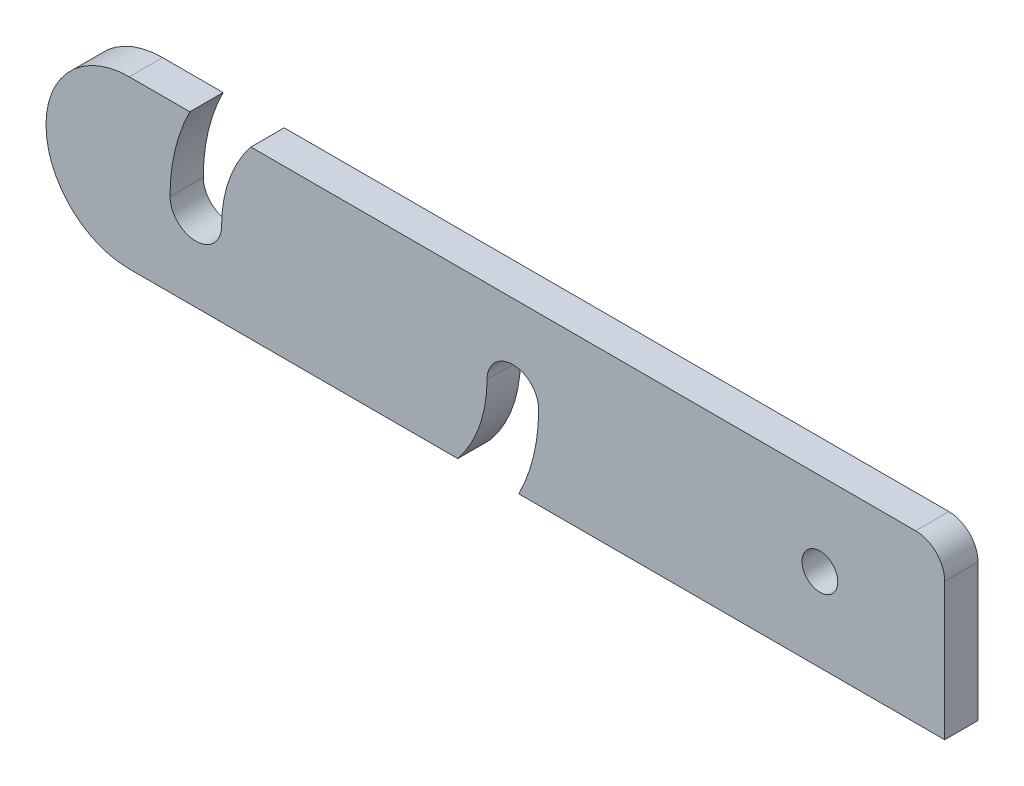
ISO-10303-21;
HEADER;
FILE_DESCRIPTION(('STEP AP214'),'2;1');
FILE_NAME('part.step','',(''),(''),'','','');
FILE_SCHEMA(('AUTOMOTIVE_DESIGN { 1 0 10303 214 1 1 1 1 }'));
ENDSEC;
DATA;
#1=APPLICATION_CONTEXT('core data for automotive mechanical design processes');
#2=APPLICATION_PROTOCOL_DEFINITION('international standard','automotive_design',2000,#1);
#3=PRODUCT_CONTEXT('',#1,'mechanical');
#4=PRODUCT('Part','Part','',(#3));
#5=PRODUCT_RELATED_PRODUCT_CATEGORY('part','',(#4));
#6=PRODUCT_DEFINITION_FORMATION('','',#4);
#7=PRODUCT_DEFINITION_CONTEXT('part definition',#1,'design');
#8=PRODUCT_DEFINITION('design','',#6,#7);
#9=PRODUCT_DEFINITION_SHAPE('','',#8);
#10=(LENGTH_UNIT() NAMED_UNIT(*) SI_UNIT(.MILLI.,.METRE.));
#11=(NAMED_UNIT(*) PLANE_ANGLE_UNIT() SI_UNIT($,.RADIAN.));
#12=(NAMED_UNIT(*) SI_UNIT($,.STERADIAN.) SOLID_ANGLE_UNIT());
#13=UNCERTAINTY_MEASURE_WITH_UNIT(LENGTH_MEASURE(1.E-05),#10,'distance_accuracy_value','');
#14=(GEOMETRIC_REPRESENTATION_CONTEXT(3) GLOBAL_UNCERTAINTY_ASSIGNED_CONTEXT((#13)) GLOBAL_UNIT_ASSIGNED_CONTEXT((#10,
#11,#12)) REPRESENTATION_CONTEXT('',''));
#15=CARTESIAN_POINT('',(0.,0.,0.));
#16=DIRECTION('',(0.,0.,1.));
#17=DIRECTION('',(1.,0.,0.));
#18=AXIS2_PLACEMENT_3D('',#15,#16,#17);
#19=CARTESIAN_POINT('',(75.8050130843792,3.5,4.));
#20=DIRECTION('',(0.,0.,1.));
#21=DIRECTION('',(1.,0.,0.));
#22=AXIS2_PLACEMENT_3D('',#19,#20,#21);
#23=PLANE('',#22);
#24=CARTESIAN_POINT('',(75.8050130843792,3.5,4.));
#25=DIRECTION('',(0.,0.,1.));
#26=DIRECTION('',(1.,0.,0.));
#27=AXIS2_PLACEMENT_3D('',#24,#25,#26);
#28=CIRCLE('',#27,3.5);
#29=CARTESIAN_POINT('',(79.3050130843792,3.49999999999998,4.));
#30=VERTEX_POINT('',#29);
#31=CARTESIAN_POINT('',(75.8050130843792,7.00000000000001,4.));
#32=VERTEX_POINT('',#31);
#33=EDGE_CURVE('E183',#30,#32,#28,.T.);
#34=ORIENTED_EDGE('',*,*,#33,.T.);
#35=DIRECTION('',(-1.,0.,0.));
#36=VECTOR('',#35,1.);
#37=CARTESIAN_POINT('',(-4.07157603148119,7.00000000000001,4.));
#38=LINE('',#37,#36);
#39=CARTESIAN_POINT('',(-4.07157603148119,7.00000000000001,4.));
#40=VERTEX_POINT('',#39);
#41=EDGE_CURVE('E106',#32,#40,#38,.T.);
#42=ORIENTED_EDGE('',*,*,#41,.T.);
#43=CARTESIAN_POINT('',(8.35751308437922,-3.,4.));
#44=DIRECTION('',(0.,0.,1.));
#45=DIRECTION('',(1.,0.,0.));
#46=AXIS2_PLACEMENT_3D('',#43,#44,#45);
#47=CIRCLE('',#46,15.9525);
#48=CARTESIAN_POINT('',(-7.59498691562078,-3.,4.));
#49=VERTEX_POINT('',#48);
#50=EDGE_CURVE('E213',#40,#49,#47,.T.);
#51=ORIENTED_EDGE('',*,*,#50,.T.);
#52=CARTESIAN_POINT('',(-10.6949869156208,-3.,4.));
#53=DIRECTION('',(0.,0.,-1.));
#54=DIRECTION('',(1.,0.,0.));
#55=AXIS2_PLACEMENT_3D('',#52,#53,#54);
#56=CIRCLE('',#55,3.1);
#57=CARTESIAN_POINT('',(-13.7949869156208,-3.,4.));
#58=VERTEX_POINT('',#57);
#59=EDGE_CURVE('E232',#49,#58,#56,.T.);
#60=ORIENTED_EDGE('',*,*,#59,.T.);
#61=CARTESIAN_POINT('',(8.35751308437922,-3.,4.));
#62=DIRECTION('',(0.,0.,-1.));
#63=DIRECTION('',(1.,0.,0.));
#64=AXIS2_PLACEMENT_3D('',#61,#62,#63);
#65=CIRCLE('',#64,22.1525);
#66=CARTESIAN_POINT('',(-11.4094607925196,7.00000000000001,4.));
#67=VERTEX_POINT('',#66);
#68=EDGE_CURVE('E229',#58,#67,#65,.T.);
#69=ORIENTED_EDGE('',*,*,#68,.T.);
#70=DIRECTION('',(-1.,0.,0.));
#71=VECTOR('',#70,1.);
#72=CARTESIAN_POINT('',(-18.6949869156208,7.00000000000001,4.));
#73=LINE('',#72,#71);
#74=CARTESIAN_POINT('',(-18.6949869156208,7.00000000000001,4.));
#75=VERTEX_POINT('',#74);
#76=EDGE_CURVE('E231',#67,#75,#73,.T.);
#77=ORIENTED_EDGE('',*,*,#76,.T.);
#78=CARTESIAN_POINT('',(-18.6949869156208,-3.,4.));
#79=DIRECTION('',(0.,0.,1.));
#80=DIRECTION('',(-1.,0.,0.));
#81=AXIS2_PLACEMENT_3D('',#78,#79,#80);
#82=CIRCLE('',#81,10.);
#83=CARTESIAN_POINT('',(-18.6949869156208,-13.,4.));
#84=VERTEX_POINT('',#83);
#85=EDGE_CURVE('E234',#75,#84,#82,.T.);
#86=ORIENTED_EDGE('',*,*,#85,.T.);
#87=DIRECTION('',(1.,0.,0.));
#88=VECTOR('',#87,1.);
#89=CARTESIAN_POINT('',(20.7866022002396,-13.,4.));
#90=LINE('',#89,#88);
#91=CARTESIAN_POINT('',(20.7866022002396,-13.,4.));
#92=VERTEX_POINT('',#91);
#93=EDGE_CURVE('E240',#84,#92,#90,.T.);
#94=ORIENTED_EDGE('',*,*,#93,.T.);
#95=CARTESIAN_POINT('',(8.35751308437922,-3.,4.));
#96=DIRECTION('',(0.,0.,1.));
#97=DIRECTION('',(1.,0.,0.));
#98=AXIS2_PLACEMENT_3D('',#95,#96,#97);
#99=CIRCLE('',#98,15.9525);
#100=CARTESIAN_POINT('',(24.3100130843792,-3.,4.));
#101=VERTEX_POINT('',#100);
#102=EDGE_CURVE('E242',#92,#101,#99,.T.);
#103=ORIENTED_EDGE('',*,*,#102,.T.);
#104=CARTESIAN_POINT('',(27.4100130843792,-3.,4.));
#105=DIRECTION('',(0.,0.,-1.));
#106=DIRECTION('',(1.,0.,0.));
#107=AXIS2_PLACEMENT_3D('',#104,#105,#106);
#108=CIRCLE('',#107,3.1);
#109=CARTESIAN_POINT('',(30.5100130843792,-3.,4.));
#110=VERTEX_POINT('',#109);
#111=EDGE_CURVE('E140',#101,#110,#108,.T.);
#112=ORIENTED_EDGE('',*,*,#111,.T.);
#113=CARTESIAN_POINT('',(8.35751308437922,-3.,4.));
#114=DIRECTION('',(0.,0.,-1.));
#115=DIRECTION('',(1.,0.,0.));
#116=AXIS2_PLACEMENT_3D('',#113,#114,#115);
#117=CIRCLE('',#116,22.1525);
#118=CARTESIAN_POINT('',(28.124486961278,-13.,4.));
#119=VERTEX_POINT('',#118);
#120=EDGE_CURVE('E134',#110,#119,#117,.T.);
#121=ORIENTED_EDGE('',*,*,#120,.T.);
#122=DIRECTION('',(1.,0.,0.));
#123=VECTOR('',#122,1.);
#124=CARTESIAN_POINT('',(28.124486961278,-13.,4.));
#125=LINE('',#124,#123);
#126=CARTESIAN_POINT('',(79.3050130843792,-13.,4.));
#127=VERTEX_POINT('',#126);
#128=EDGE_CURVE('E138',#119,#127,#125,.T.);
#129=ORIENTED_EDGE('',*,*,#128,.T.);
#130=DIRECTION('',(0.,1.,0.));
#131=VECTOR('',#130,1.);
#132=CARTESIAN_POINT('',(79.3050130843792,-13.,4.));
#133=LINE('',#132,#131);
#134=EDGE_CURVE('E48',#127,#30,#133,.T.);
#135=ORIENTED_EDGE('',*,*,#134,.T.);
#136=EDGE_LOOP('',(#34,#42,#51,#60,#69,#77,#86,#94,#103,#112,#121,#129,#135));
#137=FACE_BOUND('',#136,.T.);
#138=CARTESIAN_POINT('',(64.3050130843792,-3.,4.));
#139=DIRECTION('',(0.,0.,1.));
#140=DIRECTION('',(1.,0.,0.));
#141=AXIS2_PLACEMENT_3D('',#138,#139,#140);
#142=CIRCLE('',#141,2.15);
#143=CARTESIAN_POINT('',(66.4550130843792,-3.,4.));
#144=VERTEX_POINT('',#143);
#145=EDGE_CURVE('E162',#144,#144,#142,.T.);
#146=ORIENTED_EDGE('',*,*,#145,.F.);
#147=EDGE_LOOP('',(#146));
#148=FACE_BOUND('',#147,.T.);
#149=ADVANCED_FACE('F31',(#137,#148),#23,.T.);
#150=CARTESIAN_POINT('',(75.8050130843792,3.5,0.));
#151=DIRECTION('',(0.,0.,1.));
#152=DIRECTION('',(1.,0.,0.));
#153=AXIS2_PLACEMENT_3D('',#150,#151,#152);
#154=PLANE('',#153);
#155=CARTESIAN_POINT('',(75.8050130843792,3.5,0.));
#156=DIRECTION('',(0.,0.,1.));
#157=DIRECTION('',(1.,0.,0.));
#158=AXIS2_PLACEMENT_3D('',#155,#156,#157);
#159=CIRCLE('',#158,3.5);
#160=CARTESIAN_POINT('',(79.3050130843792,3.49999999999998,0.));
#161=VERTEX_POINT('',#160);
#162=CARTESIAN_POINT('',(75.8050130843792,7.00000000000001,0.));
#163=VERTEX_POINT('',#162);
#164=EDGE_CURVE('E158',#161,#163,#159,.T.);
#165=ORIENTED_EDGE('',*,*,#164,.F.);
#166=DIRECTION('',(0.,1.,0.));
#167=VECTOR('',#166,1.);
#168=CARTESIAN_POINT('',(79.3050130843792,-13.,0.));
#169=LINE('',#168,#167);
#170=CARTESIAN_POINT('',(79.3050130843792,-13.,0.));
#171=VERTEX_POINT('',#170);
#172=EDGE_CURVE('E98',#171,#161,#169,.T.);
#173=ORIENTED_EDGE('',*,*,#172,.F.);
#174=DIRECTION('',(1.,0.,0.));
#175=VECTOR('',#174,1.);
#176=CARTESIAN_POINT('',(28.124486961278,-13.,0.));
#177=LINE('',#176,#175);
#178=CARTESIAN_POINT('',(28.124486961278,-13.,0.));
#179=VERTEX_POINT('',#178);
#180=EDGE_CURVE('E92',#179,#171,#177,.T.);
#181=ORIENTED_EDGE('',*,*,#180,.F.);
#182=CARTESIAN_POINT('',(8.35751308437922,-3.,0.));
#183=DIRECTION('',(0.,0.,-1.));
#184=DIRECTION('',(1.,0.,0.));
#185=AXIS2_PLACEMENT_3D('',#182,#183,#184);
#186=CIRCLE('',#185,22.1525);
#187=CARTESIAN_POINT('',(30.5100130843792,-3.,0.));
#188=VERTEX_POINT('',#187);
#189=EDGE_CURVE('E148',#188,#179,#186,.T.);
#190=ORIENTED_EDGE('',*,*,#189,.F.);
#191=CARTESIAN_POINT('',(27.4100130843792,-3.,0.));
#192=DIRECTION('',(0.,0.,-1.));
#193=DIRECTION('',(1.,0.,0.));
#194=AXIS2_PLACEMENT_3D('',#191,#192,#193);
#195=CIRCLE('',#194,3.1);
#196=CARTESIAN_POINT('',(24.3100130843792,-3.,0.));
#197=VERTEX_POINT('',#196);
#198=EDGE_CURVE('E178',#197,#188,#195,.T.);
#199=ORIENTED_EDGE('',*,*,#198,.F.);
#200=CARTESIAN_POINT('',(8.35751308437922,-3.,0.));
#201=DIRECTION('',(0.,0.,1.));
#202=DIRECTION('',(1.,0.,0.));
#203=AXIS2_PLACEMENT_3D('',#200,#201,#202);
#204=CIRCLE('',#203,15.9525);
#205=CARTESIAN_POINT('',(20.7866022002396,-13.,0.));
#206=VERTEX_POINT('',#205);
#207=EDGE_CURVE('E176',#206,#197,#204,.T.);
#208=ORIENTED_EDGE('',*,*,#207,.F.);
#209=DIRECTION('',(1.,0.,0.));
#210=VECTOR('',#209,1.);
#211=CARTESIAN_POINT('',(20.7866022002396,-13.,0.));
#212=LINE('',#211,#210);
#213=CARTESIAN_POINT('',(-18.6949869156208,-13.,0.));
#214=VERTEX_POINT('',#213);
#215=EDGE_CURVE('E174',#214,#206,#212,.T.);
#216=ORIENTED_EDGE('',*,*,#215,.F.);
#217=CARTESIAN_POINT('',(-18.6949869156208,-3.,0.));
#218=DIRECTION('',(0.,0.,1.));
#219=DIRECTION('',(-1.,0.,0.));
#220=AXIS2_PLACEMENT_3D('',#217,#218,#219);
#221=CIRCLE('',#220,10.);
#222=CARTESIAN_POINT('',(-18.6949869156208,7.00000000000001,0.));
#223=VERTEX_POINT('',#222);
#224=EDGE_CURVE('E172',#223,#214,#221,.T.);
#225=ORIENTED_EDGE('',*,*,#224,.F.);
#226=DIRECTION('',(-1.,0.,0.));
#227=VECTOR('',#226,1.);
#228=CARTESIAN_POINT('',(-18.6949869156208,7.00000000000001,0.));
#229=LINE('',#228,#227);
#230=CARTESIAN_POINT('',(-11.4094607925196,7.00000000000001,0.));
#231=VERTEX_POINT('',#230);
#232=EDGE_CURVE('E170',#231,#223,#229,.T.);
#233=ORIENTED_EDGE('',*,*,#232,.F.);
#234=CARTESIAN_POINT('',(8.35751308437922,-3.,0.));
#235=DIRECTION('',(0.,0.,-1.));
#236=DIRECTION('',(1.,0.,0.));
#237=AXIS2_PLACEMENT_3D('',#234,#235,#236);
#238=CIRCLE('',#237,22.1525);
#239=CARTESIAN_POINT('',(-13.7949869156208,-3.,0.));
#240=VERTEX_POINT('',#239);
#241=EDGE_CURVE('E168',#240,#231,#238,.T.);
#242=ORIENTED_EDGE('',*,*,#241,.F.);
#243=CARTESIAN_POINT('',(-10.6949869156208,-3.,0.));
#244=DIRECTION('',(0.,0.,-1.));
#245=DIRECTION('',(1.,0.,0.));
#246=AXIS2_PLACEMENT_3D('',#243,#244,#245);
#247=CIRCLE('',#246,3.1);
#248=CARTESIAN_POINT('',(-7.59498691562078,-3.,0.));
#249=VERTEX_POINT('',#248);
#250=EDGE_CURVE('E166',#249,#240,#247,.T.);
#251=ORIENTED_EDGE('',*,*,#250,.F.);
#252=CARTESIAN_POINT('',(8.35751308437922,-3.,0.));
#253=DIRECTION('',(0.,0.,1.));
#254=DIRECTION('',(1.,0.,0.));
#255=AXIS2_PLACEMENT_3D('',#252,#253,#254);
#256=CIRCLE('',#255,15.9525);
#257=CARTESIAN_POINT('',(-4.07157603148119,7.00000000000001,0.));
#258=VERTEX_POINT('',#257);
#259=EDGE_CURVE('E164',#258,#249,#256,.T.);
#260=ORIENTED_EDGE('',*,*,#259,.F.);
#261=DIRECTION('',(-1.,0.,0.));
#262=VECTOR('',#261,1.);
#263=CARTESIAN_POINT('',(-4.07157603148119,7.00000000000001,0.));
#264=LINE('',#263,#262);
#265=EDGE_CURVE('E161',#163,#258,#264,.T.);
#266=ORIENTED_EDGE('',*,*,#265,.F.);
#267=EDGE_LOOP('',(#165,#173,#181,#190,#199,#208,#216,#225,#233,#242,#251,#260,#266));
#268=FACE_BOUND('',#267,.T.);
#269=CARTESIAN_POINT('',(64.3050130843792,-3.,0.));
#270=DIRECTION('',(0.,0.,1.));
#271=DIRECTION('',(1.,0.,0.));
#272=AXIS2_PLACEMENT_3D('',#269,#270,#271);
#273=CIRCLE('',#272,2.15);
#274=CARTESIAN_POINT('',(66.4550130843792,-3.,0.));
#275=VERTEX_POINT('',#274);
#276=EDGE_CURVE('E402',#275,#275,#273,.T.);
#277=ORIENTED_EDGE('',*,*,#276,.T.);
#278=EDGE_LOOP('',(#277));
#279=FACE_BOUND('',#278,.T.);
#280=ADVANCED_FACE('F217',(#268,#279),#154,.F.);
#281=CARTESIAN_POINT('',(75.8050130843792,3.5,4.));
#282=DIRECTION('',(0.,0.,-1.));
#283=DIRECTION('',(-1.,0.,0.));
#284=AXIS2_PLACEMENT_3D('',#281,#282,#283);
#285=CYLINDRICAL_SURFACE('',#284,3.5);
#286=ORIENTED_EDGE('',*,*,#164,.T.);
#287=DIRECTION('',(0.,0.,-1.));
#288=VECTOR('',#287,1.);
#289=CARTESIAN_POINT('',(75.8050130843792,7.00000000000001,4.));
#290=LINE('',#289,#288);
#291=EDGE_CURVE('E11',#32,#163,#290,.T.);
#292=ORIENTED_EDGE('',*,*,#291,.F.);
#293=ORIENTED_EDGE('',*,*,#33,.F.);
#294=DIRECTION('',(0.,0.,-1.));
#295=VECTOR('',#294,1.);
#296=CARTESIAN_POINT('',(79.3050130843792,3.49999999999998,4.));
#297=LINE('',#296,#295);
#298=EDGE_CURVE('E154',#30,#161,#297,.T.);
#299=ORIENTED_EDGE('',*,*,#298,.T.);
#300=EDGE_LOOP('',(#286,#292,#293,#299));
#301=FACE_BOUND('',#300,.T.);
#302=ADVANCED_FACE('F33',(#301),#285,.T.);
#303=CARTESIAN_POINT('',(-4.07157603148119,7.00000000000001,4.));
#304=DIRECTION('',(0.,-1.,0.));
#305=DIRECTION('',(1.,0.,0.));
#306=AXIS2_PLACEMENT_3D('',#303,#304,#305);
#307=PLANE('',#306);
#308=ORIENTED_EDGE('',*,*,#265,.T.);
#309=DIRECTION('',(0.,0.,-1.));
#310=VECTOR('',#309,1.);
#311=CARTESIAN_POINT('',(-4.07157603148119,7.00000000000001,4.));
#312=LINE('',#311,#310);
#313=EDGE_CURVE('E40',#40,#258,#312,.T.);
#314=ORIENTED_EDGE('',*,*,#313,.F.);
#315=ORIENTED_EDGE('',*,*,#41,.F.);
#316=ORIENTED_EDGE('',*,*,#291,.T.);
#317=EDGE_LOOP('',(#308,#314,#315,#316));
#318=FACE_BOUND('',#317,.T.);
#319=ADVANCED_FACE('F276',(#318),#307,.F.);
#320=CARTESIAN_POINT('',(8.35751308437922,-3.,4.));
#321=DIRECTION('',(0.,0.,-1.));
#322=DIRECTION('',(-1.,0.,0.));
#323=AXIS2_PLACEMENT_3D('',#320,#321,#322);
#324=CYLINDRICAL_SURFACE('',#323,15.9525);
#325=ORIENTED_EDGE('',*,*,#259,.T.);
#326=DIRECTION('',(0.,0.,-1.));
#327=VECTOR('',#326,1.);
#328=CARTESIAN_POINT('',(-7.59498691562078,-3.,4.));
#329=LINE('',#328,#327);
#330=EDGE_CURVE('E205',#49,#249,#329,.T.);
#331=ORIENTED_EDGE('',*,*,#330,.F.);
#332=ORIENTED_EDGE('',*,*,#50,.F.);
#333=ORIENTED_EDGE('',*,*,#313,.T.);
#334=EDGE_LOOP('',(#325,#331,#332,#333));
#335=FACE_BOUND('',#334,.T.);
#336=ADVANCED_FACE('F211',(#335),#324,.T.);
#337=CARTESIAN_POINT('',(-10.6949869156208,-3.,4.));
#338=DIRECTION('',(0.,0.,-1.));
#339=DIRECTION('',(-1.,0.,0.));
#340=AXIS2_PLACEMENT_3D('',#337,#338,#339);
#341=CYLINDRICAL_SURFACE('',#340,3.1);
#342=ORIENTED_EDGE('',*,*,#250,.T.);
#343=DIRECTION('',(0.,0.,-1.));
#344=VECTOR('',#343,1.);
#345=CARTESIAN_POINT('',(-13.7949869156208,-3.,4.));
#346=LINE('',#345,#344);
#347=EDGE_CURVE('E202',#58,#240,#346,.T.);
#348=ORIENTED_EDGE('',*,*,#347,.F.);
#349=ORIENTED_EDGE('',*,*,#59,.F.);
#350=ORIENTED_EDGE('',*,*,#330,.T.);
#351=EDGE_LOOP('',(#342,#348,#349,#350));
#352=FACE_BOUND('',#351,.T.);
#353=ADVANCED_FACE('F223',(#352),#341,.F.);
#354=CARTESIAN_POINT('',(8.35751308437922,-3.,4.));
#355=DIRECTION('',(0.,0.,-1.));
#356=DIRECTION('',(-1.,0.,0.));
#357=AXIS2_PLACEMENT_3D('',#354,#355,#356);
#358=CYLINDRICAL_SURFACE('',#357,22.1525);
#359=ORIENTED_EDGE('',*,*,#241,.T.);
#360=DIRECTION('',(0.,0.,-1.));
#361=VECTOR('',#360,1.);
#362=CARTESIAN_POINT('',(-11.4094607925196,7.00000000000001,4.));
#363=LINE('',#362,#361);
#364=EDGE_CURVE('E199',#67,#231,#363,.T.);
#365=ORIENTED_EDGE('',*,*,#364,.F.);
#366=ORIENTED_EDGE('',*,*,#68,.F.);
#367=ORIENTED_EDGE('',*,*,#347,.T.);
#368=EDGE_LOOP('',(#359,#365,#366,#367));
#369=FACE_BOUND('',#368,.T.);
#370=ADVANCED_FACE('F227',(#369),#358,.F.);
#371=CARTESIAN_POINT('',(-18.6949869156208,7.00000000000001,4.));
#372=DIRECTION('',(0.,-1.,0.));
#373=DIRECTION('',(1.,0.,0.));
#374=AXIS2_PLACEMENT_3D('',#371,#372,#373);
#375=PLANE('',#374);
#376=ORIENTED_EDGE('',*,*,#232,.T.);
#377=DIRECTION('',(0.,0.,-1.));
#378=VECTOR('',#377,1.);
#379=CARTESIAN_POINT('',(-18.6949869156208,7.00000000000001,4.));
#380=LINE('',#379,#378);
#381=EDGE_CURVE('E196',#75,#223,#380,.T.);
#382=ORIENTED_EDGE('',*,*,#381,.F.);
#383=ORIENTED_EDGE('',*,*,#76,.F.);
#384=ORIENTED_EDGE('',*,*,#364,.T.);
#385=EDGE_LOOP('',(#376,#382,#383,#384));
#386=FACE_BOUND('',#385,.T.);
#387=ADVANCED_FACE('F289',(#386),#375,.F.);
#388=CARTESIAN_POINT('',(-18.6949869156208,-3.,4.));
#389=DIRECTION('',(0.,0.,-1.));
#390=DIRECTION('',(-1.,0.,0.));
#391=AXIS2_PLACEMENT_3D('',#388,#389,#390);
#392=CYLINDRICAL_SURFACE('',#391,10.);
#393=ORIENTED_EDGE('',*,*,#224,.T.);
#394=DIRECTION('',(0.,0.,-1.));
#395=VECTOR('',#394,1.);
#396=CARTESIAN_POINT('',(-18.6949869156208,-13.,4.));
#397=LINE('',#396,#395);
#398=EDGE_CURVE('E193',#84,#214,#397,.T.);
#399=ORIENTED_EDGE('',*,*,#398,.F.);
#400=ORIENTED_EDGE('',*,*,#85,.F.);
#401=ORIENTED_EDGE('',*,*,#381,.T.);
#402=EDGE_LOOP('',(#393,#399,#400,#401));
#403=FACE_BOUND('',#402,.T.);
#404=ADVANCED_FACE('F292',(#403),#392,.T.);
#405=CARTESIAN_POINT('',(20.7866022002396,-13.,4.));
#406=DIRECTION('',(0.,1.,0.));
#407=DIRECTION('',(-1.,0.,0.));
#408=AXIS2_PLACEMENT_3D('',#405,#406,#407);
#409=PLANE('',#408);
#410=ORIENTED_EDGE('',*,*,#215,.T.);
#411=DIRECTION('',(0.,0.,-1.));
#412=VECTOR('',#411,1.);
#413=CARTESIAN_POINT('',(20.7866022002396,-13.,4.));
#414=LINE('',#413,#412);
#415=EDGE_CURVE('E190',#92,#206,#414,.T.);
#416=ORIENTED_EDGE('',*,*,#415,.F.);
#417=ORIENTED_EDGE('',*,*,#93,.F.);
#418=ORIENTED_EDGE('',*,*,#398,.T.);
#419=EDGE_LOOP('',(#410,#416,#417,#418));
#420=FACE_BOUND('',#419,.T.);
#421=ADVANCED_FACE('F296',(#420),#409,.F.);
#422=CARTESIAN_POINT('',(8.35751308437922,-3.,4.));
#423=DIRECTION('',(0.,0.,-1.));
#424=DIRECTION('',(-1.,0.,0.));
#425=AXIS2_PLACEMENT_3D('',#422,#423,#424);
#426=CYLINDRICAL_SURFACE('',#425,15.9525);
#427=ORIENTED_EDGE('',*,*,#207,.T.);
#428=DIRECTION('',(0.,0.,-1.));
#429=VECTOR('',#428,1.);
#430=CARTESIAN_POINT('',(24.3100130843792,-3.,4.));
#431=LINE('',#430,#429);
#432=EDGE_CURVE('E187',#101,#197,#431,.T.);
#433=ORIENTED_EDGE('',*,*,#432,.F.);
#434=ORIENTED_EDGE('',*,*,#102,.F.);
#435=ORIENTED_EDGE('',*,*,#415,.T.);
#436=EDGE_LOOP('',(#427,#433,#434,#435));
#437=FACE_BOUND('',#436,.T.);
#438=ADVANCED_FACE('F248',(#437),#426,.T.);
#439=CARTESIAN_POINT('',(27.4100130843792,-3.,4.));
#440=DIRECTION('',(0.,0.,-1.));
#441=DIRECTION('',(-1.,0.,0.));
#442=AXIS2_PLACEMENT_3D('',#439,#440,#441);
#443=CYLINDRICAL_SURFACE('',#442,3.1);
#444=ORIENTED_EDGE('',*,*,#198,.T.);
#445=DIRECTION('',(0.,0.,-1.));
#446=VECTOR('',#445,1.);
#447=CARTESIAN_POINT('',(30.5100130843792,-3.,4.));
#448=LINE('',#447,#446);
#449=EDGE_CURVE('E149',#110,#188,#448,.T.);
#450=ORIENTED_EDGE('',*,*,#449,.F.);
#451=ORIENTED_EDGE('',*,*,#111,.F.);
#452=ORIENTED_EDGE('',*,*,#432,.T.);
#453=EDGE_LOOP('',(#444,#450,#451,#452));
#454=FACE_BOUND('',#453,.T.);
#455=ADVANCED_FACE('F252',(#454),#443,.F.);
#456=CARTESIAN_POINT('',(8.35751308437922,-3.,4.));
#457=DIRECTION('',(0.,0.,-1.));
#458=DIRECTION('',(-1.,0.,0.));
#459=AXIS2_PLACEMENT_3D('',#456,#457,#458);
#460=CYLINDRICAL_SURFACE('',#459,22.1525);
#461=ORIENTED_EDGE('',*,*,#189,.T.);
#462=DIRECTION('',(0.,0.,-1.));
#463=VECTOR('',#462,1.);
#464=CARTESIAN_POINT('',(28.124486961278,-13.,4.));
#465=LINE('',#464,#463);
#466=EDGE_CURVE('E145',#119,#179,#465,.T.);
#467=ORIENTED_EDGE('',*,*,#466,.F.);
#468=ORIENTED_EDGE('',*,*,#120,.F.);
#469=ORIENTED_EDGE('',*,*,#449,.T.);
#470=EDGE_LOOP('',(#461,#467,#468,#469));
#471=FACE_BOUND('',#470,.T.);
#472=ADVANCED_FACE('F146',(#471),#460,.F.);
#473=CARTESIAN_POINT('',(28.124486961278,-13.,4.));
#474=DIRECTION('',(0.,1.,0.));
#475=DIRECTION('',(0.,0.,1.));
#476=AXIS2_PLACEMENT_3D('',#473,#474,#475);
#477=PLANE('',#476);
#478=ORIENTED_EDGE('',*,*,#180,.T.);
#479=DIRECTION('',(0.,0.,-1.));
#480=VECTOR('',#479,1.);
#481=CARTESIAN_POINT('',(79.3050130843792,-13.,4.));
#482=LINE('',#481,#480);
#483=EDGE_CURVE('E150',#127,#171,#482,.T.);
#484=ORIENTED_EDGE('',*,*,#483,.F.);
#485=ORIENTED_EDGE('',*,*,#128,.F.);
#486=ORIENTED_EDGE('',*,*,#466,.T.);
#487=EDGE_LOOP('',(#478,#484,#485,#486));
#488=FACE_BOUND('',#487,.T.);
#489=ADVANCED_FACE('F152',(#488),#477,.F.);
#490=CARTESIAN_POINT('',(79.3050130843792,-13.,4.));
#491=DIRECTION('',(-1.,0.,0.));
#492=DIRECTION('',(0.,0.,1.));
#493=AXIS2_PLACEMENT_3D('',#490,#491,#492);
#494=PLANE('',#493);
#495=ORIENTED_EDGE('',*,*,#172,.T.);
#496=ORIENTED_EDGE('',*,*,#298,.F.);
#497=ORIENTED_EDGE('',*,*,#134,.F.);
#498=ORIENTED_EDGE('',*,*,#483,.T.);
#499=EDGE_LOOP('',(#495,#496,#497,#498));
#500=FACE_BOUND('',#499,.T.);
#501=ADVANCED_FACE('F256',(#500),#494,.F.);
#502=CARTESIAN_POINT('',(64.3050130843792,-3.,4.));
#503=DIRECTION('',(0.,0.,-1.));
#504=DIRECTION('',(-1.,0.,0.));
#505=AXIS2_PLACEMENT_3D('',#502,#503,#504);
#506=CYLINDRICAL_SURFACE('',#505,2.15);
#507=ORIENTED_EDGE('',*,*,#145,.T.);
#508=EDGE_LOOP('',(#507));
#509=FACE_BOUND('',#508,.T.);
#510=ORIENTED_EDGE('',*,*,#276,.F.);
#511=EDGE_LOOP('',(#510));
#512=FACE_BOUND('',#511,.T.);
#513=ADVANCED_FACE('F258',(#509,#512),#506,.F.);
#514=CLOSED_SHELL('',(#149,#280,#302,#319,#336,#353,#370,#387,#404,#421,#438,#455,#472,#489,
#501,#513));
#515=MANIFOLD_SOLID_BREP('B2',#514);
#516=ADVANCED_BREP_SHAPE_REPRESENTATION('',(#18,#515),#14);
#517=SHAPE_DEFINITION_REPRESENTATION(#9,#516);
ENDSEC;
END-ISO-10303-21;
